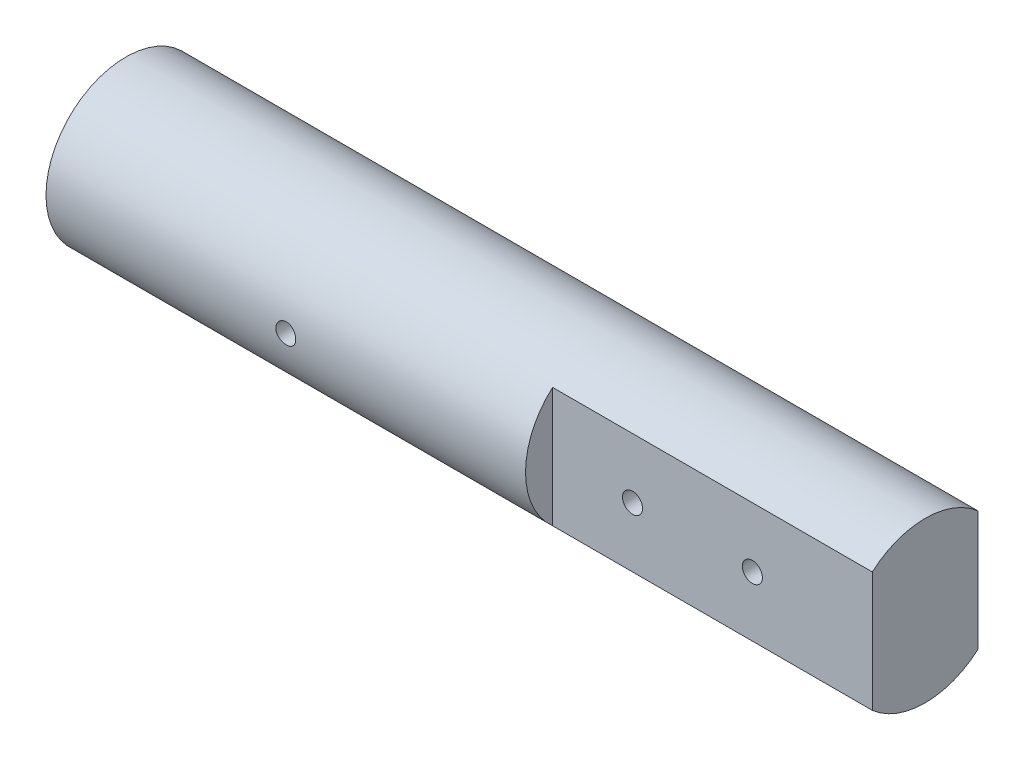
ISO-10303-21;
HEADER;
FILE_DESCRIPTION(('STEP AP214'),'2;1');
FILE_NAME('part.step','',(''),(''),'','','');
FILE_SCHEMA(('AUTOMOTIVE_DESIGN { 1 0 10303 214 1 1 1 1 }'));
ENDSEC;
DATA;
#1=APPLICATION_CONTEXT('core data for automotive mechanical design processes');
#2=APPLICATION_PROTOCOL_DEFINITION('international standard','automotive_design',2000,#1);
#3=PRODUCT_CONTEXT('',#1,'mechanical');
#4=PRODUCT('Part','Part','',(#3));
#5=PRODUCT_RELATED_PRODUCT_CATEGORY('part','',(#4));
#6=PRODUCT_DEFINITION_FORMATION('','',#4);
#7=PRODUCT_DEFINITION_CONTEXT('part definition',#1,'design');
#8=PRODUCT_DEFINITION('design','',#6,#7);
#9=PRODUCT_DEFINITION_SHAPE('','',#8);
#10=(LENGTH_UNIT() NAMED_UNIT(*) SI_UNIT(.MILLI.,.METRE.));
#11=(NAMED_UNIT(*) PLANE_ANGLE_UNIT() SI_UNIT($,.RADIAN.));
#12=(NAMED_UNIT(*) SI_UNIT($,.STERADIAN.) SOLID_ANGLE_UNIT());
#13=UNCERTAINTY_MEASURE_WITH_UNIT(LENGTH_MEASURE(1.E-05),#10,'distance_accuracy_value','');
#14=(GEOMETRIC_REPRESENTATION_CONTEXT(3) GLOBAL_UNCERTAINTY_ASSIGNED_CONTEXT((#13)) GLOBAL_UNIT_ASSIGNED_CONTEXT((#10,
#11,#12)) REPRESENTATION_CONTEXT('',''));
#15=CARTESIAN_POINT('',(0.,0.,0.));
#16=DIRECTION('',(0.,0.,1.));
#17=DIRECTION('',(1.,0.,0.));
#18=AXIS2_PLACEMENT_3D('',#15,#16,#17);
#19=CARTESIAN_POINT('',(60.,10.,0.));
#20=DIRECTION('',(-1.,0.,0.));
#21=DIRECTION('',(0.,0.,1.));
#22=AXIS2_PLACEMENT_3D('',#19,#20,#21);
#23=PLANE('',#22);
#24=DIRECTION('',(0.,-1.,0.));
#25=VECTOR('',#24,1.);
#26=CARTESIAN_POINT('',(60.,-7.5,6.61437827766147));
#27=LINE('',#26,#25);
#28=CARTESIAN_POINT('',(60.,7.5,6.61437827766147));
#29=VERTEX_POINT('',#28);
#30=CARTESIAN_POINT('',(60.,-7.5,6.61437827766147));
#31=VERTEX_POINT('',#30);
#32=EDGE_CURVE('E147',#29,#31,#27,.T.);
#33=ORIENTED_EDGE('',*,*,#32,.F.);
#34=CARTESIAN_POINT('',(60.,0.,0.));
#35=DIRECTION('',(-1.,0.,0.));
#36=DIRECTION('',(0.,0.,1.));
#37=AXIS2_PLACEMENT_3D('',#34,#35,#36);
#38=CIRCLE('',#37,10.);
#39=EDGE_CURVE('E67',#31,#29,#38,.T.);
#40=ORIENTED_EDGE('',*,*,#39,.F.);
#41=EDGE_LOOP('',(#33,#40));
#42=FACE_BOUND('',#41,.T.);
#43=ADVANCED_FACE('F49',(#42),#23,.F.);
#44=DIRECTION('',(0.,1.,0.));
#45=VECTOR('',#44,1.);
#46=CARTESIAN_POINT('',(60.,-7.5,-6.61437827766147));
#47=LINE('',#46,#45);
#48=CARTESIAN_POINT('',(60.,-7.5,-6.61437827766147));
#49=VERTEX_POINT('',#48);
#50=CARTESIAN_POINT('',(60.,7.5,-6.61437827766147));
#51=VERTEX_POINT('',#50);
#52=EDGE_CURVE('E74',#49,#51,#47,.T.);
#53=ORIENTED_EDGE('',*,*,#52,.F.);
#54=EDGE_CURVE('E167',#51,#49,#38,.T.);
#55=ORIENTED_EDGE('',*,*,#54,.F.);
#56=EDGE_LOOP('',(#53,#55));
#57=FACE_BOUND('',#56,.T.);
#58=ADVANCED_FACE('F187',(#57),#23,.F.);
#59=CARTESIAN_POINT('',(0.,0.,0.));
#60=DIRECTION('',(1.,0.,0.));
#61=DIRECTION('',(0.,0.,-1.));
#62=AXIS2_PLACEMENT_3D('',#59,#60,#61);
#63=PLANE('',#62);
#64=CARTESIAN_POINT('',(0.,0.,0.));
#65=DIRECTION('',(-1.,0.,0.));
#66=DIRECTION('',(0.,0.,1.));
#67=AXIS2_PLACEMENT_3D('',#64,#65,#66);
#68=CIRCLE('',#67,10.);
#69=CARTESIAN_POINT('',(0.,0.,10.));
#70=VERTEX_POINT('',#69);
#71=EDGE_CURVE('E61',#70,#70,#68,.T.);
#72=ORIENTED_EDGE('',*,*,#71,.T.);
#73=EDGE_LOOP('',(#72));
#74=FACE_BOUND('',#73,.T.);
#75=ADVANCED_FACE('F51',(#74),#63,.F.);
#76=CARTESIAN_POINT('',(0.,0.,0.));
#77=DIRECTION('',(-1.,0.,0.));
#78=DIRECTION('',(0.,0.,1.));
#79=AXIS2_PLACEMENT_3D('',#76,#77,#78);
#80=CYLINDRICAL_SURFACE('',#79,10.);
#81=CARTESIAN_POINT('',(31.25,0.,10.));
#82=CARTESIAN_POINT('',(31.2499970295321,-0.0699205477778802,9.99999902448215));
#83=CARTESIAN_POINT('',(31.2441135604154,-0.139884787151373,9.99925892277451));
#84=CARTESIAN_POINT('',(31.2207361227146,-0.277866401044875,9.9963777005568));
#85=CARTESIAN_POINT('',(31.2032300310383,-0.34588166531187,9.99423511720715));
#86=CARTESIAN_POINT('',(31.1571311780429,-0.477947787406524,9.98879030522203));
#87=CARTESIAN_POINT('',(31.1285458790951,-0.542001280073065,9.98548885727771));
#88=CARTESIAN_POINT('',(31.0611163580151,-0.664389737446513,9.97809350439049));
#89=CARTESIAN_POINT('',(31.0222738957346,-0.72272568077818,9.97399973542058));
#90=CARTESIAN_POINT('',(30.9352040250802,-0.832356408465653,9.96545160653163));
#91=CARTESIAN_POINT('',(30.8869314353269,-0.883615182468557,9.96099557346209));
#92=CARTESIAN_POINT('',(30.7824685882317,-0.977326396778741,9.95223863004875));
#93=CARTESIAN_POINT('',(30.7262779275434,-1.01977838819612,9.94793772762134));
#94=CARTESIAN_POINT('',(30.6073400112172,-1.09480508064196,9.93996152809793));
#95=CARTESIAN_POINT('',(30.544571319216,-1.12734604797053,9.93628838588956));
#96=CARTESIAN_POINT('',(30.4144064740263,-1.18141153828755,9.93000564228841));
#97=CARTESIAN_POINT('',(30.3470104964265,-1.2029364790326,9.92739600056568));
#98=CARTESIAN_POINT('',(30.2098779022066,-1.23424949001237,9.92355169801807));
#99=CARTESIAN_POINT('',(30.1401553711479,-1.24409835736584,9.92230991718372));
#100=CARTESIAN_POINT('',(30.0000368682641,-1.25196777477861,9.92132014071396));
#101=CARTESIAN_POINT('',(29.9296409236344,-1.2499888005012,9.92157208500754));
#102=CARTESIAN_POINT('',(29.7905975863756,-1.23430861822394,9.92353477684876));
#103=CARTESIAN_POINT('',(29.7219425068999,-1.22067438149234,9.92523718980165));
#104=CARTESIAN_POINT('',(29.5879024893905,-1.18217519159101,9.92989599878815));
#105=CARTESIAN_POINT('',(29.522517617643,-1.15731001087594,9.93285242022862));
#106=CARTESIAN_POINT('',(29.3966660004892,-1.09698277995582,9.93969557932326));
#107=CARTESIAN_POINT('',(29.3362133498755,-1.06149162685381,9.94358486605722));
#108=CARTESIAN_POINT('',(29.2220966527934,-0.980940734728453,9.95185355715299));
#109=CARTESIAN_POINT('',(29.1684329170132,-0.935880558040383,9.95623298392831));
#110=CARTESIAN_POINT('',(29.0690286446386,-0.837099555376884,9.96502554945213));
#111=CARTESIAN_POINT('',(29.023345454117,-0.78332100392,9.96943871193445));
#112=CARTESIAN_POINT('',(28.9416455599847,-0.668828584556954,9.97777316277926));
#113=CARTESIAN_POINT('',(28.905628878664,-0.608114700659119,9.98169445000753));
#114=CARTESIAN_POINT('',(28.844284339768,-0.481430835681735,9.9886057610929));
#115=CARTESIAN_POINT('',(28.8189600730594,-0.415459097668853,9.99159547200768));
#116=CARTESIAN_POINT('',(28.7797647532384,-0.280153970215524,9.99630392890031));
#117=CARTESIAN_POINT('',(28.7658931639315,-0.21082073831533,9.99802273437935));
#118=CARTESIAN_POINT('',(28.7500712878697,-0.0712565819567454,9.9999879820538));
#119=CARTESIAN_POINT('',(28.748042003818,-0.00103474509930081,10.0002441807132));
#120=CARTESIAN_POINT('',(28.755753867028,0.13874801824875,9.99928169002715));
#121=CARTESIAN_POINT('',(28.7654947636258,0.208308958782355,9.99806303209106));
#122=CARTESIAN_POINT('',(28.7964048543872,0.344562253860762,9.99429384378346));
#123=CARTESIAN_POINT('',(28.8175363817013,0.411263285212353,9.99174770406934));
#124=CARTESIAN_POINT('',(28.8705887259565,0.540174827429203,9.98560861550098));
#125=CARTESIAN_POINT('',(28.9025099092457,0.602385185732656,9.98201563110312));
#126=CARTESIAN_POINT('',(28.9764265687537,0.720902260343712,9.97415911455056));
#127=CARTESIAN_POINT('',(29.0184731449028,0.777176879971908,9.96989222021254));
#128=CARTESIAN_POINT('',(29.1113747487671,0.881898494813156,9.96117571162828));
#129=CARTESIAN_POINT('',(29.1622301261255,0.930345179168425,9.95672609013449));
#130=CARTESIAN_POINT('',(29.2716537083786,1.018315979409,9.94811552731292));
#131=CARTESIAN_POINT('',(29.3302641731552,1.05778773028396,9.94395637360664));
#132=CARTESIAN_POINT('',(29.4533291224274,1.12632644472175,9.93642705518574));
#133=CARTESIAN_POINT('',(29.5177834897383,1.15539361686418,9.93305687465513));
#134=CARTESIAN_POINT('',(29.6505376595738,1.20221328943327,9.92749925196498));
#135=CARTESIAN_POINT('',(29.718826915024,1.21999531372855,9.92530872592394));
#136=CARTESIAN_POINT('',(29.8574512418903,1.24383499693392,9.92234957953727));
#137=CARTESIAN_POINT('',(29.9277862179795,1.24989320126788,9.92158089304388));
#138=CARTESIAN_POINT('',(30.0679844646023,1.25010326804241,9.92155438491228));
#139=CARTESIAN_POINT('',(30.1378476241659,1.24433739884963,9.92228612375977));
#140=CARTESIAN_POINT('',(30.2756035646725,1.22123720242466,9.92515557268601));
#141=CARTESIAN_POINT('',(30.3434963454044,1.20390287395288,9.92729328291541));
#142=CARTESIAN_POINT('',(30.4753734783832,1.15818353684482,9.93273057887275));
#143=CARTESIAN_POINT('',(30.5393592225109,1.12980249048546,9.93602974796392));
#144=CARTESIAN_POINT('',(30.6616733270242,1.06280345107515,9.94341891622409));
#145=CARTESIAN_POINT('',(30.7200016165099,1.02418532975479,9.94750892530207));
#146=CARTESIAN_POINT('',(30.8297656126702,0.937503165632914,9.95605302376117));
#147=CARTESIAN_POINT('',(30.8811527304775,0.889377812887473,9.96050936042016));
#148=CARTESIAN_POINT('',(30.975153412584,0.785175113484186,9.9692641579645));
#149=CARTESIAN_POINT('',(31.0177649053871,0.72909589457078,9.97356258137795));
#150=CARTESIAN_POINT('',(31.0931426785526,0.610332810427104,9.98153528293373));
#151=CARTESIAN_POINT('',(31.1258709029496,0.547624639798084,9.9852071253915));
#152=CARTESIAN_POINT('',(31.1802856214581,0.417591451150639,9.99148824538362));
#153=CARTESIAN_POINT('',(31.2019841131767,0.350271540435116,9.99409867684788));
#154=CARTESIAN_POINT('',(31.2285296690856,0.23550288598396,9.99733360163873));
#155=CARTESIAN_POINT('',(31.236569470991,0.188777831758459,9.99832862947727));
#156=CARTESIAN_POINT('',(31.2473056228466,0.0947085316062166,9.99966215664594));
#157=CARTESIAN_POINT('',(31.2500020121996,0.0473642902480132,10.0000006608173));
#158=CARTESIAN_POINT('',(31.25,0.,10.));
#159=B_SPLINE_CURVE_WITH_KNOTS('',3,(#81,#82,#83,#84,#85,#86,#87,#88,#89,#90,#91,#92,#93,#94,
#95,#96,#97,#98,#99,#100,#101,#102,#103,#104,#105,#106,#107,#108,#109,#110,#111,#112,#113,#114,
#115,#116,#117,#118,#119,#120,#121,#122,#123,#124,#125,#126,#127,#128,#129,#130,#131,#132,#133,
#134,#135,#136,#137,#138,#139,#140,#141,#142,#143,#144,#145,#146,#147,#148,#149,#150,#151,#152,
#153,#154,#155,#156,#157,#158),.UNSPECIFIED.,.T.,.F.,(4,2,2,2,2,2,2,2,2,2,2,2,2,2,2,2,2,2,2,2,2,
2,2,2,2,2,2,2,2,2,2,2,2,2,2,2,2,2,4),(0.,0.209588636388122,0.419396230471711,0.62906275409088,
0.838693327955362,1.04935406600921,1.26002553900005,1.47140625159434,1.68277894748403,
1.89304612643159,2.10330484942331,2.31236348220845,2.52142635083119,2.73106713142765,
2.94071750256817,3.15181739068206,3.36291776556555,3.574088978658,3.78525030451888,
3.99500139695958,4.20474802250962,4.41380526946695,4.62286961539471,4.83301201464208,
5.04316275687541,5.25450985753783,5.46585272110766,5.67664037140459,5.88741821505308,
6.09673450601104,6.3060508193977,6.5152921235324,6.72453604956128,6.93517618845911,
7.14586599235002,7.35735701518422,7.56861749342012,7.7105942159381,7.85256989150214),.UNSPECIFIED.);
#160=CARTESIAN_POINT('',(31.25,0.,10.));
#161=VERTEX_POINT('',#160);
#162=EDGE_CURVE('E11',#161,#161,#159,.T.);
#163=ORIENTED_EDGE('',*,*,#162,.T.);
#164=EDGE_LOOP('',(#163));
#165=FACE_BOUND('',#164,.T.);
#166=ORIENTED_EDGE('',*,*,#71,.F.);
#167=EDGE_LOOP('',(#166));
#168=FACE_BOUND('',#167,.T.);
#169=ORIENTED_EDGE('',*,*,#39,.T.);
#170=DIRECTION('',(-1.,0.,0.));
#171=VECTOR('',#170,1.);
#172=CARTESIAN_POINT('',(100.,7.5,6.61437827766147));
#173=LINE('',#172,#171);
#174=CARTESIAN_POINT('',(100.,7.5,6.61437827766147));
#175=VERTEX_POINT('',#174);
#176=EDGE_CURVE('E158',#175,#29,#173,.T.);
#177=ORIENTED_EDGE('',*,*,#176,.F.);
#178=CARTESIAN_POINT('',(100.,0.,0.));
#179=DIRECTION('',(1.,0.,0.));
#180=DIRECTION('',(0.,0.,-1.));
#181=AXIS2_PLACEMENT_3D('',#178,#179,#180);
#182=CIRCLE('',#181,10.);
#183=CARTESIAN_POINT('',(100.,7.5,-6.61437827766147));
#184=VERTEX_POINT('',#183);
#185=EDGE_CURVE('E149',#184,#175,#182,.T.);
#186=ORIENTED_EDGE('',*,*,#185,.F.);
#187=DIRECTION('',(-1.,0.,0.));
#188=VECTOR('',#187,1.);
#189=CARTESIAN_POINT('',(100.,7.5,-6.61437827766147));
#190=LINE('',#189,#188);
#191=EDGE_CURVE('E161',#184,#51,#190,.T.);
#192=ORIENTED_EDGE('',*,*,#191,.T.);
#193=ORIENTED_EDGE('',*,*,#54,.T.);
#194=DIRECTION('',(-1.,0.,0.));
#195=VECTOR('',#194,1.);
#196=CARTESIAN_POINT('',(100.,-7.5,-6.61437827766147));
#197=LINE('',#196,#195);
#198=CARTESIAN_POINT('',(100.,-7.5,-6.61437827766147));
#199=VERTEX_POINT('',#198);
#200=EDGE_CURVE('E164',#199,#49,#197,.T.);
#201=ORIENTED_EDGE('',*,*,#200,.F.);
#202=CARTESIAN_POINT('',(100.,0.,0.));
#203=DIRECTION('',(1.,0.,0.));
#204=DIRECTION('',(0.,0.,-1.));
#205=AXIS2_PLACEMENT_3D('',#202,#203,#204);
#206=CIRCLE('',#205,10.);
#207=CARTESIAN_POINT('',(100.,-7.5,6.61437827766147));
#208=VERTEX_POINT('',#207);
#209=EDGE_CURVE('E143',#208,#199,#206,.T.);
#210=ORIENTED_EDGE('',*,*,#209,.F.);
#211=DIRECTION('',(-1.,0.,0.));
#212=VECTOR('',#211,1.);
#213=CARTESIAN_POINT('',(100.,-7.5,6.61437827766147));
#214=LINE('',#213,#212);
#215=EDGE_CURVE('E153',#208,#31,#214,.T.);
#216=ORIENTED_EDGE('',*,*,#215,.T.);
#217=EDGE_LOOP('',(#169,#177,#186,#192,#193,#201,#210,#216));
#218=FACE_BOUND('',#217,.T.);
#219=ADVANCED_FACE('F173',(#165,#168,#218),#80,.T.);
#220=CARTESIAN_POINT('',(100.,-7.5,-6.61437827766147));
#221=DIRECTION('',(0.,0.,1.));
#222=DIRECTION('',(1.,0.,0.));
#223=AXIS2_PLACEMENT_3D('',#220,#221,#222);
#224=PLANE('',#223);
#225=CARTESIAN_POINT('',(85.,0.,-6.61437827766148));
#226=DIRECTION('',(0.,0.,-1.));
#227=DIRECTION('',(-1.,0.,0.));
#228=AXIS2_PLACEMENT_3D('',#225,#226,#227);
#229=CIRCLE('',#228,1.24999999999999);
#230=CARTESIAN_POINT('',(83.75,0.,-6.61437827766148));
#231=VERTEX_POINT('',#230);
#232=EDGE_CURVE('E128',#231,#231,#229,.T.);
#233=ORIENTED_EDGE('',*,*,#232,.F.);
#234=EDGE_LOOP('',(#233));
#235=FACE_BOUND('',#234,.T.);
#236=CARTESIAN_POINT('',(70.,0.,-6.61437827766148));
#237=DIRECTION('',(0.,0.,-1.));
#238=DIRECTION('',(-1.,0.,0.));
#239=AXIS2_PLACEMENT_3D('',#236,#237,#238);
#240=CIRCLE('',#239,1.24999999999999);
#241=CARTESIAN_POINT('',(68.75,0.,-6.61437827766148));
#242=VERTEX_POINT('',#241);
#243=EDGE_CURVE('E134',#242,#242,#240,.T.);
#244=ORIENTED_EDGE('',*,*,#243,.F.);
#245=EDGE_LOOP('',(#244));
#246=FACE_BOUND('',#245,.T.);
#247=ORIENTED_EDGE('',*,*,#52,.T.);
#248=ORIENTED_EDGE('',*,*,#191,.F.);
#249=DIRECTION('',(0.,1.,0.));
#250=VECTOR('',#249,1.);
#251=CARTESIAN_POINT('',(100.,-7.5,-6.61437827766147));
#252=LINE('',#251,#250);
#253=EDGE_CURVE('E146',#199,#184,#252,.T.);
#254=ORIENTED_EDGE('',*,*,#253,.F.);
#255=ORIENTED_EDGE('',*,*,#200,.T.);
#256=EDGE_LOOP('',(#247,#248,#254,#255));
#257=FACE_BOUND('',#256,.T.);
#258=ADVANCED_FACE('F178',(#235,#246,#257),#224,.F.);
#259=CARTESIAN_POINT('',(100.,-7.5,6.61437827766147));
#260=DIRECTION('',(0.,0.,-1.));
#261=DIRECTION('',(-1.,0.,0.));
#262=AXIS2_PLACEMENT_3D('',#259,#260,#261);
#263=PLANE('',#262);
#264=CARTESIAN_POINT('',(70.,0.,6.61437827766148));
#265=DIRECTION('',(0.,0.,1.));
#266=DIRECTION('',(1.,0.,0.));
#267=AXIS2_PLACEMENT_3D('',#264,#265,#266);
#268=CIRCLE('',#267,1.24999999999999);
#269=CARTESIAN_POINT('',(71.25,0.,6.61437827766148));
#270=VERTEX_POINT('',#269);
#271=EDGE_CURVE('E118',#270,#270,#268,.T.);
#272=ORIENTED_EDGE('',*,*,#271,.F.);
#273=EDGE_LOOP('',(#272));
#274=FACE_BOUND('',#273,.T.);
#275=CARTESIAN_POINT('',(85.,0.,6.61437827766148));
#276=DIRECTION('',(0.,0.,1.));
#277=DIRECTION('',(1.,0.,0.));
#278=AXIS2_PLACEMENT_3D('',#275,#276,#277);
#279=CIRCLE('',#278,1.24999999999999);
#280=CARTESIAN_POINT('',(86.25,0.,6.61437827766148));
#281=VERTEX_POINT('',#280);
#282=EDGE_CURVE('E117',#281,#281,#279,.T.);
#283=ORIENTED_EDGE('',*,*,#282,.F.);
#284=EDGE_LOOP('',(#283));
#285=FACE_BOUND('',#284,.T.);
#286=ORIENTED_EDGE('',*,*,#32,.T.);
#287=ORIENTED_EDGE('',*,*,#215,.F.);
#288=DIRECTION('',(0.,-1.,0.));
#289=VECTOR('',#288,1.);
#290=CARTESIAN_POINT('',(100.,-7.5,6.61437827766147));
#291=LINE('',#290,#289);
#292=EDGE_CURVE('E151',#175,#208,#291,.T.);
#293=ORIENTED_EDGE('',*,*,#292,.F.);
#294=ORIENTED_EDGE('',*,*,#176,.T.);
#295=EDGE_LOOP('',(#286,#287,#293,#294));
#296=FACE_BOUND('',#295,.T.);
#297=ADVANCED_FACE('F185',(#274,#285,#296),#263,.F.);
#298=CARTESIAN_POINT('',(100.,0.,0.));
#299=DIRECTION('',(1.,0.,0.));
#300=DIRECTION('',(0.,0.,-1.));
#301=AXIS2_PLACEMENT_3D('',#298,#299,#300);
#302=PLANE('',#301);
#303=ORIENTED_EDGE('',*,*,#209,.T.);
#304=ORIENTED_EDGE('',*,*,#253,.T.);
#305=ORIENTED_EDGE('',*,*,#185,.T.);
#306=ORIENTED_EDGE('',*,*,#292,.T.);
#307=EDGE_LOOP('',(#303,#304,#305,#306));
#308=FACE_BOUND('',#307,.T.);
#309=ADVANCED_FACE('F180',(#308),#302,.T.);
#310=CARTESIAN_POINT('',(30.,0.,10.));
#311=DIRECTION('',(0.,0.,1.));
#312=DIRECTION('',(1.,0.,0.));
#313=AXIS2_PLACEMENT_3D('',#310,#311,#312);
#314=CYLINDRICAL_SURFACE('',#313,1.24999999999999);
#315=CARTESIAN_POINT('',(30.,0.,0.));
#316=DIRECTION('',(0.,0.,1.));
#317=DIRECTION('',(1.,0.,0.));
#318=AXIS2_PLACEMENT_3D('',#315,#316,#317);
#319=CIRCLE('',#318,1.25);
#320=CARTESIAN_POINT('',(31.25,0.,0.));
#321=VERTEX_POINT('',#320);
#322=EDGE_CURVE('E140',#321,#321,#319,.T.);
#323=ORIENTED_EDGE('',*,*,#322,.F.);
#324=EDGE_LOOP('',(#323));
#325=FACE_BOUND('',#324,.T.);
#326=ORIENTED_EDGE('',*,*,#162,.F.);
#327=EDGE_LOOP('',(#326));
#328=FACE_BOUND('',#327,.T.);
#329=ADVANCED_FACE('F205',(#325,#328),#314,.F.);
#330=CARTESIAN_POINT('',(30.,0.,0.));
#331=DIRECTION('',(0.,0.,1.));
#332=DIRECTION('',(1.,0.,0.));
#333=AXIS2_PLACEMENT_3D('',#330,#331,#332);
#334=CONICAL_SURFACE('',#333,1.25,1.02974425867665);
#335=CARTESIAN_POINT('',(30.,0.,-0.751075773784452));
#336=VERTEX_POINT('',#335);
#337=VERTEX_LOOP('',#336);
#338=FACE_BOUND('',#337,.T.);
#339=ORIENTED_EDGE('',*,*,#322,.T.);
#340=EDGE_LOOP('',(#339));
#341=FACE_BOUND('',#340,.T.);
#342=ADVANCED_FACE('F207',(#338,#341),#334,.F.);
#343=CARTESIAN_POINT('',(70.,0.,-1.61437827766148));
#344=DIRECTION('',(0.,0.,-1.));
#345=DIRECTION('',(-1.,0.,0.));
#346=AXIS2_PLACEMENT_3D('',#343,#344,#345);
#347=CONICAL_SURFACE('',#346,1.25,1.02974425867665);
#348=CARTESIAN_POINT('',(70.,0.,-0.863302503877024));
#349=VERTEX_POINT('',#348);
#350=VERTEX_LOOP('',#349);
#351=FACE_BOUND('',#350,.T.);
#352=CARTESIAN_POINT('',(70.,0.,-1.61437827766148));
#353=DIRECTION('',(0.,0.,-1.));
#354=DIRECTION('',(-1.,0.,0.));
#355=AXIS2_PLACEMENT_3D('',#352,#353,#354);
#356=CIRCLE('',#355,1.25);
#357=CARTESIAN_POINT('',(68.75,0.,-1.61437827766148));
#358=VERTEX_POINT('',#357);
#359=EDGE_CURVE('E137',#358,#358,#356,.T.);
#360=ORIENTED_EDGE('',*,*,#359,.T.);
#361=EDGE_LOOP('',(#360));
#362=FACE_BOUND('',#361,.T.);
#363=ADVANCED_FACE('F213',(#351,#362),#347,.F.);
#364=CARTESIAN_POINT('',(70.,0.,-6.61437827766147));
#365=DIRECTION('',(0.,0.,-1.));
#366=DIRECTION('',(-1.,0.,0.));
#367=AXIS2_PLACEMENT_3D('',#364,#365,#366);
#368=CYLINDRICAL_SURFACE('',#367,1.24999999999999);
#369=ORIENTED_EDGE('',*,*,#359,.F.);
#370=EDGE_LOOP('',(#369));
#371=FACE_BOUND('',#370,.T.);
#372=ORIENTED_EDGE('',*,*,#243,.T.);
#373=EDGE_LOOP('',(#372));
#374=FACE_BOUND('',#373,.T.);
#375=ADVANCED_FACE('F247',(#371,#374),#368,.F.);
#376=CARTESIAN_POINT('',(85.,0.,-1.61437827766148));
#377=DIRECTION('',(0.,0.,-1.));
#378=DIRECTION('',(-1.,0.,0.));
#379=AXIS2_PLACEMENT_3D('',#376,#377,#378);
#380=CONICAL_SURFACE('',#379,1.25,1.02974425867665);
#381=CARTESIAN_POINT('',(85.,0.,-0.863302503877024));
#382=VERTEX_POINT('',#381);
#383=VERTEX_LOOP('',#382);
#384=FACE_BOUND('',#383,.T.);
#385=CARTESIAN_POINT('',(85.,0.,-1.61437827766148));
#386=DIRECTION('',(0.,0.,-1.));
#387=DIRECTION('',(-1.,0.,0.));
#388=AXIS2_PLACEMENT_3D('',#385,#386,#387);
#389=CIRCLE('',#388,1.25);
#390=CARTESIAN_POINT('',(83.75,0.,-1.61437827766148));
#391=VERTEX_POINT('',#390);
#392=EDGE_CURVE('E131',#391,#391,#389,.T.);
#393=ORIENTED_EDGE('',*,*,#392,.T.);
#394=EDGE_LOOP('',(#393));
#395=FACE_BOUND('',#394,.T.);
#396=ADVANCED_FACE('F244',(#384,#395),#380,.F.);
#397=CARTESIAN_POINT('',(85.,0.,-6.61437827766147));
#398=DIRECTION('',(0.,0.,-1.));
#399=DIRECTION('',(-1.,0.,0.));
#400=AXIS2_PLACEMENT_3D('',#397,#398,#399);
#401=CYLINDRICAL_SURFACE('',#400,1.24999999999999);
#402=ORIENTED_EDGE('',*,*,#392,.F.);
#403=EDGE_LOOP('',(#402));
#404=FACE_BOUND('',#403,.T.);
#405=ORIENTED_EDGE('',*,*,#232,.T.);
#406=EDGE_LOOP('',(#405));
#407=FACE_BOUND('',#406,.T.);
#408=ADVANCED_FACE('F236',(#404,#407),#401,.F.);
#409=CARTESIAN_POINT('',(85.,0.,1.61437827766148));
#410=DIRECTION('',(0.,0.,1.));
#411=DIRECTION('',(1.,0.,0.));
#412=AXIS2_PLACEMENT_3D('',#409,#410,#411);
#413=CONICAL_SURFACE('',#412,1.25,1.02974425867665);
#414=CARTESIAN_POINT('',(85.,0.,0.863302503877024));
#415=VERTEX_POINT('',#414);
#416=VERTEX_LOOP('',#415);
#417=FACE_BOUND('',#416,.T.);
#418=CARTESIAN_POINT('',(85.,0.,1.61437827766148));
#419=DIRECTION('',(0.,0.,1.));
#420=DIRECTION('',(1.,0.,0.));
#421=AXIS2_PLACEMENT_3D('',#418,#419,#420);
#422=CIRCLE('',#421,1.25);
#423=CARTESIAN_POINT('',(86.25,0.,1.61437827766148));
#424=VERTEX_POINT('',#423);
#425=EDGE_CURVE('E121',#424,#424,#422,.T.);
#426=ORIENTED_EDGE('',*,*,#425,.T.);
#427=EDGE_LOOP('',(#426));
#428=FACE_BOUND('',#427,.T.);
#429=ADVANCED_FACE('F230',(#417,#428),#413,.F.);
#430=CARTESIAN_POINT('',(85.,0.,6.61437827766147));
#431=DIRECTION('',(0.,0.,1.));
#432=DIRECTION('',(1.,0.,0.));
#433=AXIS2_PLACEMENT_3D('',#430,#431,#432);
#434=CYLINDRICAL_SURFACE('',#433,1.24999999999999);
#435=ORIENTED_EDGE('',*,*,#425,.F.);
#436=EDGE_LOOP('',(#435));
#437=FACE_BOUND('',#436,.T.);
#438=ORIENTED_EDGE('',*,*,#282,.T.);
#439=EDGE_LOOP('',(#438));
#440=FACE_BOUND('',#439,.T.);
#441=ADVANCED_FACE('F111',(#437,#440),#434,.F.);
#442=CARTESIAN_POINT('',(70.,0.,1.61437827766148));
#443=DIRECTION('',(0.,0.,1.));
#444=DIRECTION('',(1.,0.,0.));
#445=AXIS2_PLACEMENT_3D('',#442,#443,#444);
#446=CONICAL_SURFACE('',#445,1.25,1.02974425867665);
#447=CARTESIAN_POINT('',(70.,0.,0.863302503877024));
#448=VERTEX_POINT('',#447);
#449=VERTEX_LOOP('',#448);
#450=FACE_BOUND('',#449,.T.);
#451=CARTESIAN_POINT('',(70.,0.,1.61437827766148));
#452=DIRECTION('',(0.,0.,1.));
#453=DIRECTION('',(1.,0.,0.));
#454=AXIS2_PLACEMENT_3D('',#451,#452,#453);
#455=CIRCLE('',#454,1.25);
#456=CARTESIAN_POINT('',(71.25,0.,1.61437827766148));
#457=VERTEX_POINT('',#456);
#458=EDGE_CURVE('E115',#457,#457,#455,.T.);
#459=ORIENTED_EDGE('',*,*,#458,.T.);
#460=EDGE_LOOP('',(#459));
#461=FACE_BOUND('',#460,.T.);
#462=ADVANCED_FACE('F107',(#450,#461),#446,.F.);
#463=CARTESIAN_POINT('',(70.,0.,6.61437827766147));
#464=DIRECTION('',(0.,0.,1.));
#465=DIRECTION('',(1.,0.,0.));
#466=AXIS2_PLACEMENT_3D('',#463,#464,#465);
#467=CYLINDRICAL_SURFACE('',#466,1.24999999999999);
#468=ORIENTED_EDGE('',*,*,#458,.F.);
#469=EDGE_LOOP('',(#468));
#470=FACE_BOUND('',#469,.T.);
#471=ORIENTED_EDGE('',*,*,#271,.T.);
#472=EDGE_LOOP('',(#471));
#473=FACE_BOUND('',#472,.T.);
#474=ADVANCED_FACE('F110',(#470,#473),#467,.F.);
#475=CLOSED_SHELL('',(#43,#58,#75,#219,#258,#297,#309,#329,#342,#363,#375,#396,#408,#429,#441,
#462,#474));
#476=MANIFOLD_SOLID_BREP('B2',#475);
#477=ADVANCED_BREP_SHAPE_REPRESENTATION('',(#18,#476),#14);
#478=SHAPE_DEFINITION_REPRESENTATION(#9,#477);
ENDSEC;
END-ISO-10303-21;
